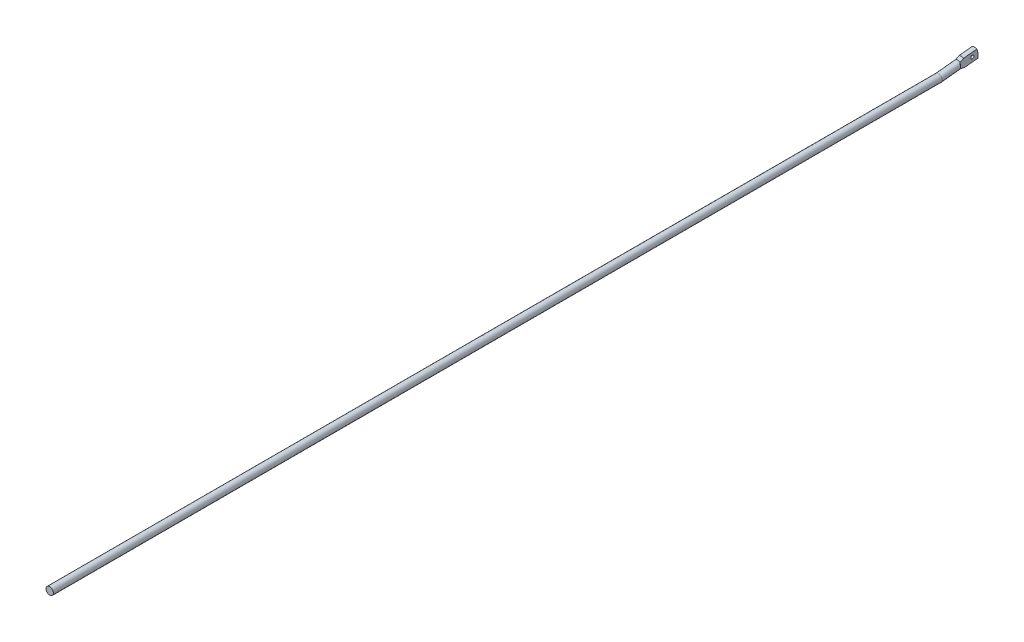
ISO-10303-21;
HEADER;
FILE_DESCRIPTION(('STEP AP214'),'2;1');
FILE_NAME('part.step','',(''),(''),'','','');
FILE_SCHEMA(('AUTOMOTIVE_DESIGN { 1 0 10303 214 1 1 1 1 }'));
ENDSEC;
DATA;
#1=APPLICATION_CONTEXT('core data for automotive mechanical design processes');
#2=APPLICATION_PROTOCOL_DEFINITION('international standard','automotive_design',2000,#1);
#3=PRODUCT_CONTEXT('',#1,'mechanical');
#4=PRODUCT('Part','Part','',(#3));
#5=PRODUCT_RELATED_PRODUCT_CATEGORY('part','',(#4));
#6=PRODUCT_DEFINITION_FORMATION('','',#4);
#7=PRODUCT_DEFINITION_CONTEXT('part definition',#1,'design');
#8=PRODUCT_DEFINITION('design','',#6,#7);
#9=PRODUCT_DEFINITION_SHAPE('','',#8);
#10=(LENGTH_UNIT() NAMED_UNIT(*) SI_UNIT(.MILLI.,.METRE.));
#11=(NAMED_UNIT(*) PLANE_ANGLE_UNIT() SI_UNIT($,.RADIAN.));
#12=(NAMED_UNIT(*) SI_UNIT($,.STERADIAN.) SOLID_ANGLE_UNIT());
#13=UNCERTAINTY_MEASURE_WITH_UNIT(LENGTH_MEASURE(1.E-05),#10,'distance_accuracy_value','');
#14=(GEOMETRIC_REPRESENTATION_CONTEXT(3) GLOBAL_UNCERTAINTY_ASSIGNED_CONTEXT((#13)) GLOBAL_UNIT_ASSIGNED_CONTEXT((#10,
#11,#12)) REPRESENTATION_CONTEXT('',''));
#15=CARTESIAN_POINT('',(0.,0.,0.));
#16=DIRECTION('',(0.,0.,1.));
#17=DIRECTION('',(1.,0.,0.));
#18=AXIS2_PLACEMENT_3D('',#15,#16,#17);
#19=CARTESIAN_POINT('',(-2.5,7.61717424557741,-980.536621425158));
#20=DIRECTION('',(-1.,0.,0.));
#21=DIRECTION('',(0.,0.,1.));
#22=AXIS2_PLACEMENT_3D('',#19,#20,#21);
#23=PLANE('',#22);
#24=CARTESIAN_POINT('',(-2.5,3.5769986310211,-994.03286862779));
#25=DIRECTION('',(-1.,0.,0.));
#26=DIRECTION('',(0.,0.,1.));
#27=AXIS2_PLACEMENT_3D('',#24,#25,#26);
#28=CIRCLE('',#27,1.74999999999999);
#29=CARTESIAN_POINT('',(-2.5,3.5769986310211,-992.28286862779));
#30=VERTEX_POINT('',#29);
#31=EDGE_CURVE('E349',#30,#30,#28,.F.);
#32=ORIENTED_EDGE('',*,*,#31,.T.);
#33=EDGE_LOOP('',(#32));
#34=FACE_BOUND('',#33,.T.);
#35=DIRECTION('',(0.,0.104528463267654,-0.994521895368273));
#36=VECTOR('',#35,1.);
#37=CARTESIAN_POINT('',(-2.5,-2.37312779579035,-981.586644481289));
#38=LINE('',#37,#36);
#39=CARTESIAN_POINT('',(-2.5,-1.95501394271992,-985.56473206276));
#40=VERTEX_POINT('',#39);
#41=CARTESIAN_POINT('',(-2.5,-0.446604129216878,-999.916292774754));
#42=VERTEX_POINT('',#41);
#43=EDGE_CURVE('E176',#40,#42,#38,.T.);
#44=ORIENTED_EDGE('',*,*,#43,.F.);
#45=CARTESIAN_POINT('',(-2.50000000000001,-1.95501394271993,-985.56473206276));
#46=CARTESIAN_POINT('',(-2.5,-1.87151736928505,-985.218811835304));
#47=CARTESIAN_POINT('',(-2.5,-1.7871312000397,-984.873101913032));
#48=CARTESIAN_POINT('',(-2.5,-1.61592312390341,-984.182319762794));
#49=CARTESIAN_POINT('',(-2.5,-1.52910143805446,-983.837247479968));
#50=CARTESIAN_POINT('',(-2.5,-1.3523476645828,-983.147882356959));
#51=CARTESIAN_POINT('',(-2.5,-1.26241546264849,-982.803589545917));
#52=CARTESIAN_POINT('',(-2.5,-1.12438158295086,-982.287972798332));
#53=CARTESIAN_POINT('',(-2.5,-1.07784551512851,-982.116229868329));
#54=CARTESIAN_POINT('',(-2.5,-0.983533663422658,-981.773082259129));
#55=CARTESIAN_POINT('',(-2.5,-0.935757861195313,-981.601677584975));
#56=CARTESIAN_POINT('',(-2.5,-0.887265014428223,-981.430474009944));
#57=B_SPLINE_CURVE_WITH_KNOTS('',3,(#45,#46,#47,#48,#49,#50,#51,#52,#53,#54,#55,#56),
.UNSPECIFIED.,.F.,.F.,(4,2,2,2,2,4),(0.,1.06756870345046,2.13504082826117,3.20255222448837,
3.73635627278108,4.27016822406192),.UNSPECIFIED.);
#58=CARTESIAN_POINT('',(-2.5,-0.887265014427482,-981.430474009944));
#59=VERTEX_POINT('',#58);
#60=EDGE_CURVE('E107',#40,#59,#57,.T.);
#61=ORIENTED_EDGE('',*,*,#60,.T.);
#62=DIRECTION('',(0.,0.994521895368273,0.104528463267659));
#63=VECTOR('',#62,1.);
#64=CARTESIAN_POINT('',(-2.5,7.61717424557741,-980.536621425158));
#65=LINE('',#64,#63);
#66=CARTESIAN_POINT('',(-2.5,5.32352223151078,-980.777693966062));
#67=VERTEX_POINT('',#66);
#68=EDGE_CURVE('E125',#59,#67,#65,.T.);
#69=ORIENTED_EDGE('',*,*,#68,.T.);
#70=CARTESIAN_POINT('',(-2.50000000000003,5.3235222315119,-980.777693966062));
#71=CARTESIAN_POINT('',(-2.50000000000001,5.40655061798867,-980.935074102451));
#72=CARTESIAN_POINT('',(-2.5,5.48891943992778,-981.092800025408));
#73=CARTESIAN_POINT('',(-2.5,5.65251475102364,-981.408840499493));
#74=CARTESIAN_POINT('',(-2.5,5.73374125707437,-981.567155041873));
#75=CARTESIAN_POINT('',(-2.5,5.97596151512484,-982.042805469103));
#76=CARTESIAN_POINT('',(-2.5,6.13551098315573,-982.36087670001));
#77=CARTESIAN_POINT('',(-2.5,6.45172933091329,-982.998428365211));
#78=CARTESIAN_POINT('',(-2.5,6.6083983163946,-983.317908747231));
#79=CARTESIAN_POINT('',(-2.5,6.91948677013617,-983.957999489525));
#80=CARTESIAN_POINT('',(-2.5,7.07390603359083,-984.278609949417));
#81=CARTESIAN_POINT('',(-2.5,7.22749886594398,-984.599611076187));
#82=B_SPLINE_CURVE_WITH_KNOTS('',3,(#70,#71,#72,#73,#74,#75,#76,#77,#78,#79,#80,#81),
.UNSPECIFIED.,.F.,.F.,(4,2,2,2,2,4),(0.,0.533811951280704,1.06761599957337,2.13512739580016,
3.20259952061063,4.27016822406078),.UNSPECIFIED.);
#83=CARTESIAN_POINT('',(-2.5,7.22749886594397,-984.599611076187));
#84=VERTEX_POINT('',#83);
#85=EDGE_CURVE('E68',#67,#84,#82,.T.);
#86=ORIENTED_EDGE('',*,*,#85,.T.);
#87=DIRECTION('',(0.,0.104528463267654,-0.994521895368273));
#88=VECTOR('',#87,1.);
#89=CARTESIAN_POINT('',(-2.5,6.80938501287366,-980.621523494717));
#90=LINE('',#89,#88);
#91=CARTESIAN_POINT('',(-2.5,8.73590867944714,-998.951171788182));
#92=VERTEX_POINT('',#91);
#93=EDGE_CURVE('E128',#84,#92,#90,.T.);
#94=ORIENTED_EDGE('',*,*,#93,.T.);
#95=CARTESIAN_POINT('',(-2.5,2.21812860854165,-981.104083988003));
#96=DIRECTION('',(1.,0.,0.));
#97=DIRECTION('',(0.,0.,1.));
#98=AXIS2_PLACEMENT_3D('',#95,#96,#97);
#99=CIRCLE('',#98,19.);
#100=EDGE_CURVE('E120',#42,#92,#99,.T.);
#101=ORIENTED_EDGE('',*,*,#100,.F.);
#102=EDGE_LOOP('',(#44,#61,#69,#86,#94,#101));
#103=FACE_BOUND('',#102,.T.);
#104=ADVANCED_FACE('F44',(#34,#103),#23,.T.);
#105=CARTESIAN_POINT('',(2.5,-2.15610327033601,-981.563834284507));
#106=DIRECTION('',(1.,0.,0.));
#107=DIRECTION('',(0.,0.,-1.));
#108=AXIS2_PLACEMENT_3D('',#105,#106,#107);
#109=PLANE('',#108);
#110=CARTESIAN_POINT('',(2.5,3.5769986310211,-994.03286862779));
#111=DIRECTION('',(1.,0.,0.));
#112=DIRECTION('',(0.,0.,-1.));
#113=AXIS2_PLACEMENT_3D('',#110,#111,#112);
#114=CIRCLE('',#113,1.74999999999999);
#115=CARTESIAN_POINT('',(2.5,3.5769986310211,-995.78286862779));
#116=VERTEX_POINT('',#115);
#117=EDGE_CURVE('E347',#116,#116,#114,.T.);
#118=ORIENTED_EDGE('',*,*,#117,.F.);
#119=EDGE_LOOP('',(#118));
#120=FACE_BOUND('',#119,.T.);
#121=DIRECTION('',(0.,-0.994521895368274,-0.104528463267652));
#122=VECTOR('',#121,1.);
#123=CARTESIAN_POINT('',(2.5,2.21812860854166,-981.104083988003));
#124=LINE('',#123,#122);
#125=CARTESIAN_POINT('',(2.5,5.3235222315108,-980.777693966062));
#126=VERTEX_POINT('',#125);
#127=CARTESIAN_POINT('',(2.5,-0.887265014427479,-981.430474009944));
#128=VERTEX_POINT('',#127);
#129=EDGE_CURVE('E103',#126,#128,#124,.T.);
#130=ORIENTED_EDGE('',*,*,#129,.T.);
#131=CARTESIAN_POINT('',(2.5,-0.887265014428257,-981.430474009944));
#132=CARTESIAN_POINT('',(2.5,-0.935757861195345,-981.601677584975));
#133=CARTESIAN_POINT('',(2.5,-0.983533663422688,-981.773082259129));
#134=CARTESIAN_POINT('',(2.5,-1.07784551512854,-982.11622986833));
#135=CARTESIAN_POINT('',(2.5,-1.12438158295089,-982.287972798332));
#136=CARTESIAN_POINT('',(2.5,-1.26241546264851,-982.803589545917));
#137=CARTESIAN_POINT('',(2.5,-1.35234766458281,-983.147882356959));
#138=CARTESIAN_POINT('',(2.5,-1.52910143805445,-983.837247479968));
#139=CARTESIAN_POINT('',(2.5,-1.61592312390339,-984.182319762794));
#140=CARTESIAN_POINT('',(2.5,-1.78713120003968,-984.873101913031));
#141=CARTESIAN_POINT('',(2.5,-1.87151736928504,-985.218811835304));
#142=CARTESIAN_POINT('',(2.5,-1.95501394271993,-985.56473206276));
#143=B_SPLINE_CURVE_WITH_KNOTS('',3,(#131,#132,#133,#134,#135,#136,#137,#138,#139,#140,#141,
#142),.UNSPECIFIED.,.F.,.F.,(4,2,2,2,2,4),(0.,0.533811951280832,1.06761599957354,
2.13512739580063,3.20259952061123,4.27016822406169),.UNSPECIFIED.);
#144=CARTESIAN_POINT('',(2.5,-1.95501394271993,-985.56473206276));
#145=VERTEX_POINT('',#144);
#146=EDGE_CURVE('E54',#128,#145,#143,.T.);
#147=ORIENTED_EDGE('',*,*,#146,.T.);
#148=DIRECTION('',(0.,0.104528463267654,-0.994521895368273));
#149=VECTOR('',#148,1.);
#150=CARTESIAN_POINT('',(2.5,-2.37312779579034,-981.586644481289));
#151=LINE('',#150,#149);
#152=CARTESIAN_POINT('',(2.5,-0.446604129216877,-999.916292774754));
#153=VERTEX_POINT('',#152);
#154=EDGE_CURVE('E132',#145,#153,#151,.T.);
#155=ORIENTED_EDGE('',*,*,#154,.T.);
#156=CARTESIAN_POINT('',(2.5,2.21812860854165,-981.104083988003));
#157=DIRECTION('',(1.,0.,0.));
#158=DIRECTION('',(0.,0.,-1.));
#159=AXIS2_PLACEMENT_3D('',#156,#157,#158);
#160=CIRCLE('',#159,19.);
#161=CARTESIAN_POINT('',(2.5,8.73590867944713,-998.951171788182));
#162=VERTEX_POINT('',#161);
#163=EDGE_CURVE('E173',#162,#153,#160,.F.);
#164=ORIENTED_EDGE('',*,*,#163,.F.);
#165=DIRECTION('',(0.,0.104528463267654,-0.994521895368273));
#166=VECTOR('',#165,1.);
#167=CARTESIAN_POINT('',(2.5,6.80938501287365,-980.621523494717));
#168=LINE('',#167,#166);
#169=CARTESIAN_POINT('',(2.5,7.22749886594397,-984.599611076187));
#170=VERTEX_POINT('',#169);
#171=EDGE_CURVE('E106',#170,#162,#168,.T.);
#172=ORIENTED_EDGE('',*,*,#171,.F.);
#173=CARTESIAN_POINT('',(2.5,7.22749886594397,-984.599611076187));
#174=CARTESIAN_POINT('',(2.5,7.07390603359083,-984.278609949417));
#175=CARTESIAN_POINT('',(2.5,6.91948677013617,-983.957999489525));
#176=CARTESIAN_POINT('',(2.5,6.6083983163946,-983.317908747231));
#177=CARTESIAN_POINT('',(2.5,6.45172933091329,-982.998428365211));
#178=CARTESIAN_POINT('',(2.5,6.13551098315572,-982.36087670001));
#179=CARTESIAN_POINT('',(2.5,5.97596151512482,-982.042805469103));
#180=CARTESIAN_POINT('',(2.5,5.73374125707433,-981.567155041873));
#181=CARTESIAN_POINT('',(2.5,5.65251475102362,-981.408840499493));
#182=CARTESIAN_POINT('',(2.5,5.48891943992775,-981.092800025408));
#183=CARTESIAN_POINT('',(2.5,5.40655061798863,-980.935074102451));
#184=CARTESIAN_POINT('',(2.5,5.32352223151185,-980.777693966061));
#185=B_SPLINE_CURVE_WITH_KNOTS('',3,(#173,#174,#175,#176,#177,#178,#179,#180,#181,#182,#183,
#184),.UNSPECIFIED.,.F.,.F.,(4,2,2,2,2,4),(0.,1.06756870345015,2.13504082826062,
3.20255222448754,3.73635627278008,4.2701682240609),.UNSPECIFIED.);
#186=EDGE_CURVE('E61',#170,#126,#185,.T.);
#187=ORIENTED_EDGE('',*,*,#186,.T.);
#188=EDGE_LOOP('',(#130,#147,#155,#164,#172,#187));
#189=FACE_BOUND('',#188,.T.);
#190=ADVANCED_FACE('F101',(#120,#189),#109,.T.);
#191=CARTESIAN_POINT('',(0.,-0.0586601670859596,-959.441885791399));
#192=DIRECTION('',(0.,0.104528463267654,-0.994521895368273));
#193=DIRECTION('',(0.,0.994521895368273,0.104528463267654));
#194=AXIS2_PLACEMENT_3D('',#191,#192,#193);
#195=CYLINDRICAL_SURFACE('',#194,4.);
#196=CARTESIAN_POINT('',(0.,2.21812860854165,-981.104083988003));
#197=DIRECTION('',(0.,0.104528463267654,-0.994521895368273));
#198=DIRECTION('',(0.,0.994521895368273,0.104528463267654));
#199=AXIS2_PLACEMENT_3D('',#196,#197,#198);
#200=CIRCLE('',#199,4.);
#201=EDGE_CURVE('E118',#128,#59,#200,.T.);
#202=ORIENTED_EDGE('',*,*,#201,.F.);
#203=CARTESIAN_POINT('',(0.,2.4794497667108,-983.590388726424));
#204=DIRECTION('',(-0.707106781186572,-0.0739127852035644,0.70323317625338));
#205=DIRECTION('',(-0.707106781186523,0.0739127852035695,-0.703233176253428));
#206=AXIS2_PLACEMENT_3D('',#203,#204,#205);
#207=ELLIPSE('',#206,5.65685424949258,4.);
#208=EDGE_CURVE('E112',#128,#126,#207,.T.);
#209=ORIENTED_EDGE('',*,*,#208,.T.);
#210=EDGE_CURVE('E116',#67,#126,#200,.T.);
#211=ORIENTED_EDGE('',*,*,#210,.F.);
#212=CARTESIAN_POINT('',(0.,2.47944976671077,-983.590388726423));
#213=DIRECTION('',(0.707106781186546,-0.0739127852035671,0.703233176253406));
#214=DIRECTION('',(0.707106781186549,0.0739127852035668,-0.703233176253402));
#215=AXIS2_PLACEMENT_3D('',#212,#213,#214);
#216=ELLIPSE('',#215,5.65685424949237,4.);
#217=EDGE_CURVE('E121',#67,#59,#216,.T.);
#218=ORIENTED_EDGE('',*,*,#217,.T.);
#219=EDGE_LOOP('',(#202,#209,#211,#218));
#220=FACE_BOUND('',#219,.T.);
#221=CARTESIAN_POINT('',(0.,0.,-960.));
#222=DIRECTION('',(0.,0.052335956242944,-0.998629534754574));
#223=DIRECTION('',(0.,-0.998629534754574,-0.052335956242944));
#224=AXIS2_PLACEMENT_3D('',#221,#222,#223);
#225=ELLIPSE('',#224,4.00548938399168,4.);
#226=CARTESIAN_POINT('',(0.,-4.,-960.209631117132));
#227=VERTEX_POINT('',#226);
#228=EDGE_CURVE('E137',#227,#227,#225,.T.);
#229=ORIENTED_EDGE('',*,*,#228,.T.);
#230=EDGE_LOOP('',(#229));
#231=FACE_BOUND('',#230,.T.);
#232=ADVANCED_FACE('F113',(#220,#231),#195,.T.);
#233=CARTESIAN_POINT('',(0.,0.,0.));
#234=DIRECTION('',(0.,0.,1.));
#235=DIRECTION('',(1.,0.,0.));
#236=AXIS2_PLACEMENT_3D('',#233,#234,#235);
#237=PLANE('',#236);
#238=CARTESIAN_POINT('',(0.,0.,0.));
#239=DIRECTION('',(0.,0.,1.));
#240=DIRECTION('',(1.,0.,0.));
#241=AXIS2_PLACEMENT_3D('',#238,#239,#240);
#242=CIRCLE('',#241,4.);
#243=CARTESIAN_POINT('',(4.,0.,0.));
#244=VERTEX_POINT('',#243);
#245=EDGE_CURVE('E124',#244,#244,#242,.T.);
#246=ORIENTED_EDGE('',*,*,#245,.T.);
#247=EDGE_LOOP('',(#246));
#248=FACE_BOUND('',#247,.T.);
#249=ADVANCED_FACE('F194',(#248),#237,.T.);
#250=CARTESIAN_POINT('',(0.,0.,0.));
#251=DIRECTION('',(0.,0.,-1.));
#252=DIRECTION('',(-1.,0.,0.));
#253=AXIS2_PLACEMENT_3D('',#250,#251,#252);
#254=CYLINDRICAL_SURFACE('',#253,4.);
#255=ORIENTED_EDGE('',*,*,#245,.F.);
#256=EDGE_LOOP('',(#255));
#257=FACE_BOUND('',#256,.T.);
#258=ORIENTED_EDGE('',*,*,#228,.F.);
#259=EDGE_LOOP('',(#258));
#260=FACE_BOUND('',#259,.T.);
#261=ADVANCED_FACE('F192',(#257,#260),#254,.T.);
#262=CARTESIAN_POINT('',(0.,2.21812860854166,-981.104083988003));
#263=DIRECTION('',(0.,0.104528463267654,-0.994521895368273));
#264=DIRECTION('',(0.,0.994521895368273,0.104528463267654));
#265=AXIS2_PLACEMENT_3D('',#262,#263,#264);
#266=CYLINDRICAL_SURFACE('',#265,5.24999999999999);
#267=ORIENTED_EDGE('',*,*,#93,.F.);
#268=CARTESIAN_POINT('',(0.,2.63624246161198,-985.082171569473));
#269=DIRECTION('',(0.,0.104528463267654,-0.994521895368273));
#270=DIRECTION('',(0.,0.994521895368273,0.104528463267654));
#271=AXIS2_PLACEMENT_3D('',#268,#269,#270);
#272=CIRCLE('',#271,5.24999999999999);
#273=EDGE_CURVE('E12',#84,#170,#272,.T.);
#274=ORIENTED_EDGE('',*,*,#273,.T.);
#275=ORIENTED_EDGE('',*,*,#171,.T.);
#276=CARTESIAN_POINT('',(-2.5,8.73590867944714,-998.951171788182));
#277=CARTESIAN_POINT('',(-2.37406361899788,8.80196249558142,-998.927041866078));
#278=CARTESIAN_POINT('',(-2.24522197832637,8.86301476466105,-998.904336323095));
#279=CARTESIAN_POINT('',(-1.98257821292427,8.97475000214985,-998.862228628386));
#280=CARTESIAN_POINT('',(-1.84877543610339,9.02543160169337,-998.842826912802));
#281=CARTESIAN_POINT('',(-1.57731857635465,9.11596647555293,-998.807817190864));
#282=CARTESIAN_POINT('',(-1.43967125417843,9.15583758244263,-998.79220294139));
#283=CARTESIAN_POINT('',(-1.16126356961884,9.22456173006626,-998.765093754154));
#284=CARTESIAN_POINT('',(-1.02050342428338,9.25341553645731,-998.75359853014));
#285=CARTESIAN_POINT('',(-0.736616321104379,9.2999184004699,-998.734990997899));
#286=CARTESIAN_POINT('',(-0.593485839137083,9.31754887921067,-998.727885957666));
#287=CARTESIAN_POINT('',(-0.306057923240076,9.34139040093912,-998.718263159953));
#288=CARTESIAN_POINT('',(-0.16175999428695,9.34759631395727,-998.71574746323));
#289=CARTESIAN_POINT('',(0.12688450982263,9.34852109340904,-998.71537307717));
#290=CARTESIAN_POINT('',(0.271231086634439,9.34323951869553,-998.717514566681));
#291=CARTESIAN_POINT('',(0.558840942332063,9.3212378137016,-998.72639878748));
#292=CARTESIAN_POINT('',(0.70210467338117,9.30452275880726,-998.733139477154));
#293=CARTESIAN_POINT('',(0.989180563563958,9.25938642539008,-998.751216644991));
#294=CARTESIAN_POINT('',(1.13295477034871,9.23075649470722,-998.762634978874));
#295=CARTESIAN_POINT('',(1.41732786465945,9.16201651984323,-998.789778169505));
#296=CARTESIAN_POINT('',(1.55792645157375,9.12190539369828,-998.805503432122));
#297=CARTESIAN_POINT('',(1.83518936792464,9.03043263324046,-998.8409083955));
#298=CARTESIAN_POINT('',(1.9718459618637,8.97905038278865,-998.860595337086));
#299=CARTESIAN_POINT('',(2.24000951850167,8.86548274977098,-998.903417967962));
#300=CARTESIAN_POINT('',(2.37151728281092,8.80329905712013,-998.92655311769));
#301=CARTESIAN_POINT('',(2.49999999999999,8.73590867944714,-998.951171788182));
#302=B_SPLINE_CURVE_WITH_KNOTS('',3,(#276,#277,#278,#279,#280,#281,#282,#283,#284,#285,#286,
#287,#288,#289,#290,#291,#292,#293,#294,#295,#296,#297,#298,#299,#300,#301),.UNSPECIFIED.,.F.,
.F.,(4,2,2,2,2,2,2,2,2,2,2,2,4),(0.,0.432612120372937,0.865281306146859,1.29723237423067,
1.72915341802441,2.1617876089786,2.5946160182015,3.02746104936834,3.46011406278097,
3.90068563919336,4.34129874782623,4.7827246086869,5.22408146937285),.UNSPECIFIED.);
#303=EDGE_CURVE('E166',#92,#162,#302,.T.);
#304=ORIENTED_EDGE('',*,*,#303,.F.);
#305=EDGE_LOOP('',(#267,#274,#275,#304));
#306=FACE_BOUND('',#305,.T.);
#307=ADVANCED_FACE('F162',(#306),#266,.T.);
#308=CARTESIAN_POINT('',(0.,2.21812860854166,-981.104083988003));
#309=DIRECTION('',(0.,0.104528463267654,-0.994521895368273));
#310=DIRECTION('',(0.,0.994521895368273,0.104528463267654));
#311=AXIS2_PLACEMENT_3D('',#308,#309,#310);
#312=CYLINDRICAL_SURFACE('',#311,5.25000000000001);
#313=ORIENTED_EDGE('',*,*,#154,.F.);
#314=CARTESIAN_POINT('',(0.,2.63624246161208,-985.082171569474));
#315=DIRECTION('',(0.,0.104528463267654,-0.994521895368273));
#316=DIRECTION('',(0.,0.994521895368273,0.104528463267654));
#317=AXIS2_PLACEMENT_3D('',#314,#315,#316);
#318=CIRCLE('',#317,5.25000000000001);
#319=EDGE_CURVE('E149',#145,#40,#318,.T.);
#320=ORIENTED_EDGE('',*,*,#319,.T.);
#321=ORIENTED_EDGE('',*,*,#43,.T.);
#322=CARTESIAN_POINT('',(2.5,-0.446604129216877,-999.916292774754));
#323=CARTESIAN_POINT('',(2.37406361899788,-0.516231403891813,-999.90642350994));
#324=CARTESIAN_POINT('',(2.24522197832637,-0.580670282244037,-999.89690761804));
#325=CARTESIAN_POINT('',(1.98257821292427,-0.698718518714512,-999.878951139638));
#326=CARTESIAN_POINT('',(1.84877543610338,-0.752326447201124,-999.870510695144));
#327=CARTESIAN_POINT('',(1.57731857635464,-0.848161847332905,-999.85508927833));
#328=CARTESIAN_POINT('',(1.43967125417842,-0.890408059884576,-999.848105906918));
#329=CARTESIAN_POINT('',(1.16126356961882,-0.963266736950038,-999.835877674198));
#330=CARTESIAN_POINT('',(1.02050342428336,-0.993880009904614,-999.830632692082));
#331=CARTESIAN_POINT('',(0.736616321104356,-1.04323539825597,-999.822100268149));
#332=CARTESIAN_POINT('',(0.593485839137062,-1.06195782966425,-999.818816072737));
#333=CARTESIAN_POINT('',(0.306057923240054,-1.08727904908357,-999.814360487336));
#334=CARTESIAN_POINT('',(0.161759994286925,-1.09387239077191,-999.813190046491));
#335=CARTESIAN_POINT('',(-0.12688450982266,-1.09485480081257,-999.813016114124));
#336=CARTESIAN_POINT('',(-0.271231086634469,-1.0892434004735,-999.814012705822));
#337=CARTESIAN_POINT('',(-0.558840942332093,-1.0658753521537,-999.818128373395));
#338=CARTESIAN_POINT('',(-0.7021046733812,-1.04812409312515,-999.821246507502));
#339=CARTESIAN_POINT('',(-0.989180563563989,-1.00021564235713,-999.829544274451));
#340=CARTESIAN_POINT('',(-1.13295477034874,-0.96983733924657,-999.834760593047));
#341=CARTESIAN_POINT('',(-1.41732786465948,-0.896956111100589,-999.847018795438));
#342=CARTESIAN_POINT('',(-1.55792645157378,-0.854452043359738,-999.854060851282));
#343=CARTESIAN_POINT('',(-1.83518936792467,-0.757617076386287,-999.869673874973));
#344=CARTESIAN_POINT('',(-1.97184596186374,-0.703264506074337,-999.878247639081));
#345=CARTESIAN_POINT('',(-2.2400095185017,-0.583275272726413,-999.896522454127));
#346=CARTESIAN_POINT('',(-2.37151728281094,-0.517640374857961,-999.906223328646));
#347=CARTESIAN_POINT('',(-2.5,-0.446604129216872,-999.916292774754));
#348=B_SPLINE_CURVE_WITH_KNOTS('',3,(#322,#323,#324,#325,#326,#327,#328,#329,#330,#331,#332,
#333,#334,#335,#336,#337,#338,#339,#340,#341,#342,#343,#344,#345,#346,#347),.UNSPECIFIED.,.F.,
.F.,(4,2,2,2,2,2,2,2,2,2,2,2,4),(0.,0.432612120372943,0.865281306146869,1.29723237423069,
1.72915341802443,2.16178760897862,2.59461601820153,3.02746104936837,3.460114062781,
3.90068563919338,4.34129874782626,4.78272460868695,5.22408146937285),.UNSPECIFIED.);
#349=EDGE_CURVE('E140',#153,#42,#348,.T.);
#350=ORIENTED_EDGE('',*,*,#349,.F.);
#351=EDGE_LOOP('',(#313,#320,#321,#350));
#352=FACE_BOUND('',#351,.T.);
#353=ADVANCED_FACE('F151',(#352),#312,.T.);
#354=CARTESIAN_POINT('',(7.5,2.21812860854165,-981.104083988003));
#355=DIRECTION('',(-1.,0.,0.));
#356=DIRECTION('',(0.,0.,1.));
#357=AXIS2_PLACEMENT_3D('',#354,#355,#356);
#358=CYLINDRICAL_SURFACE('',#357,19.);
#359=ORIENTED_EDGE('',*,*,#100,.T.);
#360=ORIENTED_EDGE('',*,*,#303,.T.);
#361=ORIENTED_EDGE('',*,*,#163,.T.);
#362=ORIENTED_EDGE('',*,*,#349,.T.);
#363=EDGE_LOOP('',(#359,#360,#361,#362));
#364=FACE_BOUND('',#363,.T.);
#365=ADVANCED_FACE('F155',(#364),#358,.T.);
#366=CARTESIAN_POINT('',(4.,15.7360119749539,-978.17503477502));
#367=DIRECTION('',(-0.707106781186572,-0.0739127852035644,0.70323317625338));
#368=DIRECTION('',(0.705161999394255,0.,0.709046228824536));
#369=AXIS2_PLACEMENT_3D('',#366,#367,#368);
#370=PLANE('',#369);
#371=ORIENTED_EDGE('',*,*,#129,.F.);
#372=ORIENTED_EDGE('',*,*,#208,.F.);
#373=EDGE_LOOP('',(#371,#372));
#374=FACE_BOUND('',#373,.T.);
#375=ADVANCED_FACE('F123',(#374),#370,.F.);
#376=CARTESIAN_POINT('',(-2.5,15.8928046698554,-979.666817618072));
#377=DIRECTION('',(0.707106781186546,-0.0739127852035671,0.703233176253406));
#378=DIRECTION('',(0.705161999394281,0.,-0.70904622882451));
#379=AXIS2_PLACEMENT_3D('',#376,#377,#378);
#380=PLANE('',#379);
#381=ORIENTED_EDGE('',*,*,#68,.F.);
#382=ORIENTED_EDGE('',*,*,#217,.F.);
#383=EDGE_LOOP('',(#381,#382));
#384=FACE_BOUND('',#383,.T.);
#385=ADVANCED_FACE('F160',(#384),#380,.F.);
#386=CARTESIAN_POINT('',(0.,2.63624246161208,-985.082171569474));
#387=DIRECTION('',(0.,0.104528463267654,-0.994521895368273));
#388=DIRECTION('',(0.,0.994521895368273,0.104528463267654));
#389=AXIS2_PLACEMENT_3D('',#386,#387,#388);
#390=CONICAL_SURFACE('',#389,5.25000000000001,0.302884868374967);
#391=ORIENTED_EDGE('',*,*,#146,.F.);
#392=ORIENTED_EDGE('',*,*,#201,.T.);
#393=ORIENTED_EDGE('',*,*,#60,.F.);
#394=ORIENTED_EDGE('',*,*,#319,.F.);
#395=EDGE_LOOP('',(#391,#392,#393,#394));
#396=FACE_BOUND('',#395,.T.);
#397=ADVANCED_FACE('F223',(#396),#390,.T.);
#398=CARTESIAN_POINT('',(0.,2.63624246161199,-985.082171569473));
#399=DIRECTION('',(0.,0.104528463267654,-0.994521895368273));
#400=DIRECTION('',(0.,0.994521895368273,0.104528463267654));
#401=AXIS2_PLACEMENT_3D('',#398,#399,#400);
#402=CONICAL_SURFACE('',#401,5.24999999999999,0.302884868374965);
#403=ORIENTED_EDGE('',*,*,#85,.F.);
#404=ORIENTED_EDGE('',*,*,#210,.T.);
#405=ORIENTED_EDGE('',*,*,#186,.F.);
#406=ORIENTED_EDGE('',*,*,#273,.F.);
#407=EDGE_LOOP('',(#403,#404,#405,#406));
#408=FACE_BOUND('',#407,.T.);
#409=ADVANCED_FACE('F47',(#408),#402,.T.);
#410=CARTESIAN_POINT('',(-7.44974746830585,3.5769986310211,-994.03286862779));
#411=DIRECTION('',(1.,0.,0.));
#412=DIRECTION('',(0.,0.,-1.));
#413=AXIS2_PLACEMENT_3D('',#410,#411,#412);
#414=CYLINDRICAL_SURFACE('',#413,1.74999999999999);
#415=ORIENTED_EDGE('',*,*,#117,.T.);
#416=EDGE_LOOP('',(#415));
#417=FACE_BOUND('',#416,.T.);
#418=ORIENTED_EDGE('',*,*,#31,.F.);
#419=EDGE_LOOP('',(#418));
#420=FACE_BOUND('',#419,.T.);
#421=ADVANCED_FACE('F287',(#417,#420),#414,.F.);
#422=CLOSED_SHELL('',(#104,#190,#232,#249,#261,#307,#353,#365,#375,#385,#397,#409,#421));
#423=MANIFOLD_SOLID_BREP('B2',#422);
#424=ADVANCED_BREP_SHAPE_REPRESENTATION('',(#18,#423),#14);
#425=SHAPE_DEFINITION_REPRESENTATION(#9,#424);
ENDSEC;
END-ISO-10303-21;
